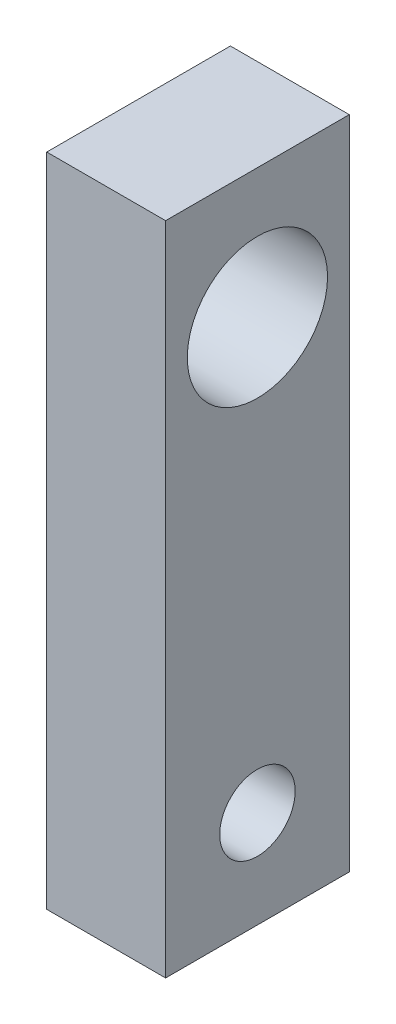
ISO-10303-21;
HEADER;
FILE_DESCRIPTION(('STEP AP214'),'2;1');
FILE_NAME('part.step','',(''),(''),'','','');
FILE_SCHEMA(('AUTOMOTIVE_DESIGN { 1 0 10303 214 1 1 1 1 }'));
ENDSEC;
DATA;
#1=APPLICATION_CONTEXT('core data for automotive mechanical design processes');
#2=APPLICATION_PROTOCOL_DEFINITION('international standard','automotive_design',2000,#1);
#3=PRODUCT_CONTEXT('',#1,'mechanical');
#4=PRODUCT('Part','Part','',(#3));
#5=PRODUCT_RELATED_PRODUCT_CATEGORY('part','',(#4));
#6=PRODUCT_DEFINITION_FORMATION('','',#4);
#7=PRODUCT_DEFINITION_CONTEXT('part definition',#1,'design');
#8=PRODUCT_DEFINITION('design','',#6,#7);
#9=PRODUCT_DEFINITION_SHAPE('','',#8);
#10=(LENGTH_UNIT() NAMED_UNIT(*) SI_UNIT(.MILLI.,.METRE.));
#11=(NAMED_UNIT(*) PLANE_ANGLE_UNIT() SI_UNIT($,.RADIAN.));
#12=(NAMED_UNIT(*) SI_UNIT($,.STERADIAN.) SOLID_ANGLE_UNIT());
#13=UNCERTAINTY_MEASURE_WITH_UNIT(LENGTH_MEASURE(1.E-05),#10,'distance_accuracy_value','');
#14=(GEOMETRIC_REPRESENTATION_CONTEXT(3) GLOBAL_UNCERTAINTY_ASSIGNED_CONTEXT((#13)) GLOBAL_UNIT_ASSIGNED_CONTEXT((#10,
#11,#12)) REPRESENTATION_CONTEXT('',''));
#15=CARTESIAN_POINT('',(0.,0.,0.));
#16=DIRECTION('',(0.,0.,1.));
#17=DIRECTION('',(1.,0.,0.));
#18=AXIS2_PLACEMENT_3D('',#15,#16,#17);
#19=CARTESIAN_POINT('',(3.67,0.,0.));
#20=DIRECTION('',(-1.,0.,0.));
#21=DIRECTION('',(0.,0.,1.));
#22=AXIS2_PLACEMENT_3D('',#19,#20,#21);
#23=PLANE('',#22);
#24=DIRECTION('',(0.,-1.,0.));
#25=VECTOR('',#24,1.);
#26=CARTESIAN_POINT('',(3.67,0.,0.));
#27=LINE('',#26,#25);
#28=CARTESIAN_POINT('',(3.67,20.25,0.));
#29=VERTEX_POINT('',#28);
#30=CARTESIAN_POINT('',(3.67,0.,0.));
#31=VERTEX_POINT('',#30);
#32=EDGE_CURVE('E95',#29,#31,#27,.T.);
#33=ORIENTED_EDGE('',*,*,#32,.T.);
#34=DIRECTION('',(0.,0.,-1.));
#35=VECTOR('',#34,1.);
#36=CARTESIAN_POINT('',(3.67,0.,0.));
#37=LINE('',#36,#35);
#38=CARTESIAN_POINT('',(3.67,0.,-5.67));
#39=VERTEX_POINT('',#38);
#40=EDGE_CURVE('E90',#31,#39,#37,.T.);
#41=ORIENTED_EDGE('',*,*,#40,.T.);
#42=DIRECTION('',(0.,1.,0.));
#43=VECTOR('',#42,1.);
#44=CARTESIAN_POINT('',(3.67,0.,-5.67));
#45=LINE('',#44,#43);
#46=CARTESIAN_POINT('',(3.67,20.25,-5.67));
#47=VERTEX_POINT('',#46);
#48=EDGE_CURVE('E93',#39,#47,#45,.T.);
#49=ORIENTED_EDGE('',*,*,#48,.T.);
#50=DIRECTION('',(0.,0.,1.));
#51=VECTOR('',#50,1.);
#52=CARTESIAN_POINT('',(3.67,20.25,0.));
#53=LINE('',#52,#51);
#54=EDGE_CURVE('E60',#47,#29,#53,.T.);
#55=ORIENTED_EDGE('',*,*,#54,.T.);
#56=EDGE_LOOP('',(#33,#41,#49,#55));
#57=FACE_BOUND('',#56,.T.);
#58=CARTESIAN_POINT('',(3.67,16.25,-2.835));
#59=DIRECTION('',(1.,0.,0.));
#60=DIRECTION('',(0.,0.,-1.));
#61=AXIS2_PLACEMENT_3D('',#58,#59,#60);
#62=CIRCLE('',#61,2.165);
#63=CARTESIAN_POINT('',(3.67,16.25,-5.));
#64=VERTEX_POINT('',#63);
#65=EDGE_CURVE('E110',#64,#64,#62,.T.);
#66=ORIENTED_EDGE('',*,*,#65,.F.);
#67=EDGE_LOOP('',(#66));
#68=FACE_BOUND('',#67,.T.);
#69=CARTESIAN_POINT('',(3.67,3.,-2.835));
#70=DIRECTION('',(1.,0.,0.));
#71=DIRECTION('',(0.,0.,-1.));
#72=AXIS2_PLACEMENT_3D('',#69,#70,#71);
#73=CIRCLE('',#72,1.165);
#74=CARTESIAN_POINT('',(3.67,3.,-4.));
#75=VERTEX_POINT('',#74);
#76=EDGE_CURVE('E125',#75,#75,#73,.T.);
#77=ORIENTED_EDGE('',*,*,#76,.F.);
#78=EDGE_LOOP('',(#77));
#79=FACE_BOUND('',#78,.T.);
#80=ADVANCED_FACE('F43',(#57,#68,#79),#23,.F.);
#81=CARTESIAN_POINT('',(0.,0.,0.));
#82=DIRECTION('',(-1.,0.,0.));
#83=DIRECTION('',(0.,0.,1.));
#84=AXIS2_PLACEMENT_3D('',#81,#82,#83);
#85=PLANE('',#84);
#86=CARTESIAN_POINT('',(0.,16.25,-2.835));
#87=DIRECTION('',(1.,0.,0.));
#88=DIRECTION('',(0.,0.,-1.));
#89=AXIS2_PLACEMENT_3D('',#86,#87,#88);
#90=CIRCLE('',#89,2.165);
#91=CARTESIAN_POINT('',(0.,16.25,-5.));
#92=VERTEX_POINT('',#91);
#93=EDGE_CURVE('E122',#92,#92,#90,.T.);
#94=ORIENTED_EDGE('',*,*,#93,.T.);
#95=EDGE_LOOP('',(#94));
#96=FACE_BOUND('',#95,.T.);
#97=DIRECTION('',(0.,-1.,0.));
#98=VECTOR('',#97,1.);
#99=CARTESIAN_POINT('',(0.,0.,0.));
#100=LINE('',#99,#98);
#101=CARTESIAN_POINT('',(0.,20.25,0.));
#102=VERTEX_POINT('',#101);
#103=CARTESIAN_POINT('',(0.,0.,0.));
#104=VERTEX_POINT('',#103);
#105=EDGE_CURVE('E107',#102,#104,#100,.T.);
#106=ORIENTED_EDGE('',*,*,#105,.F.);
#107=DIRECTION('',(0.,0.,1.));
#108=VECTOR('',#107,1.);
#109=CARTESIAN_POINT('',(0.,20.25,0.));
#110=LINE('',#109,#108);
#111=CARTESIAN_POINT('',(0.,20.25,-5.67));
#112=VERTEX_POINT('',#111);
#113=EDGE_CURVE('E83',#112,#102,#110,.T.);
#114=ORIENTED_EDGE('',*,*,#113,.F.);
#115=DIRECTION('',(0.,1.,0.));
#116=VECTOR('',#115,1.);
#117=CARTESIAN_POINT('',(0.,0.,-5.67));
#118=LINE('',#117,#116);
#119=CARTESIAN_POINT('',(0.,0.,-5.67));
#120=VERTEX_POINT('',#119);
#121=EDGE_CURVE('E77',#120,#112,#118,.T.);
#122=ORIENTED_EDGE('',*,*,#121,.F.);
#123=DIRECTION('',(0.,0.,-1.));
#124=VECTOR('',#123,1.);
#125=CARTESIAN_POINT('',(0.,0.,0.));
#126=LINE('',#125,#124);
#127=EDGE_CURVE('E99',#104,#120,#126,.T.);
#128=ORIENTED_EDGE('',*,*,#127,.F.);
#129=EDGE_LOOP('',(#106,#114,#122,#128));
#130=FACE_BOUND('',#129,.T.);
#131=CARTESIAN_POINT('',(0.,3.,-2.835));
#132=DIRECTION('',(1.,0.,0.));
#133=DIRECTION('',(0.,0.,-1.));
#134=AXIS2_PLACEMENT_3D('',#131,#132,#133);
#135=CIRCLE('',#134,1.165);
#136=CARTESIAN_POINT('',(0.,3.,-4.));
#137=VERTEX_POINT('',#136);
#138=EDGE_CURVE('E128',#137,#137,#135,.T.);
#139=ORIENTED_EDGE('',*,*,#138,.T.);
#140=EDGE_LOOP('',(#139));
#141=FACE_BOUND('',#140,.T.);
#142=ADVANCED_FACE('F118',(#96,#130,#141),#85,.T.);
#143=CARTESIAN_POINT('',(3.67,0.,0.));
#144=DIRECTION('',(0.,0.,-1.));
#145=DIRECTION('',(-1.,0.,0.));
#146=AXIS2_PLACEMENT_3D('',#143,#144,#145);
#147=PLANE('',#146);
#148=ORIENTED_EDGE('',*,*,#105,.T.);
#149=DIRECTION('',(-1.,0.,0.));
#150=VECTOR('',#149,1.);
#151=CARTESIAN_POINT('',(3.67,0.,0.));
#152=LINE('',#151,#150);
#153=EDGE_CURVE('E11',#31,#104,#152,.T.);
#154=ORIENTED_EDGE('',*,*,#153,.F.);
#155=ORIENTED_EDGE('',*,*,#32,.F.);
#156=DIRECTION('',(-1.,0.,0.));
#157=VECTOR('',#156,1.);
#158=CARTESIAN_POINT('',(3.67,20.25,0.));
#159=LINE('',#158,#157);
#160=EDGE_CURVE('E103',#29,#102,#159,.T.);
#161=ORIENTED_EDGE('',*,*,#160,.T.);
#162=EDGE_LOOP('',(#148,#154,#155,#161));
#163=FACE_BOUND('',#162,.T.);
#164=ADVANCED_FACE('F45',(#163),#147,.F.);
#165=CARTESIAN_POINT('',(3.67,0.,0.));
#166=DIRECTION('',(0.,1.,0.));
#167=DIRECTION('',(0.,0.,1.));
#168=AXIS2_PLACEMENT_3D('',#165,#166,#167);
#169=PLANE('',#168);
#170=ORIENTED_EDGE('',*,*,#127,.T.);
#171=DIRECTION('',(-1.,0.,0.));
#172=VECTOR('',#171,1.);
#173=CARTESIAN_POINT('',(3.67,0.,-5.67));
#174=LINE('',#173,#172);
#175=EDGE_CURVE('E52',#39,#120,#174,.T.);
#176=ORIENTED_EDGE('',*,*,#175,.F.);
#177=ORIENTED_EDGE('',*,*,#40,.F.);
#178=ORIENTED_EDGE('',*,*,#153,.T.);
#179=EDGE_LOOP('',(#170,#176,#177,#178));
#180=FACE_BOUND('',#179,.T.);
#181=ADVANCED_FACE('F98',(#180),#169,.F.);
#182=CARTESIAN_POINT('',(3.67,0.,-5.67));
#183=DIRECTION('',(0.,0.,1.));
#184=DIRECTION('',(1.,0.,0.));
#185=AXIS2_PLACEMENT_3D('',#182,#183,#184);
#186=PLANE('',#185);
#187=ORIENTED_EDGE('',*,*,#121,.T.);
#188=DIRECTION('',(-1.,0.,0.));
#189=VECTOR('',#188,1.);
#190=CARTESIAN_POINT('',(3.67,20.25,-5.67));
#191=LINE('',#190,#189);
#192=EDGE_CURVE('E100',#47,#112,#191,.T.);
#193=ORIENTED_EDGE('',*,*,#192,.F.);
#194=ORIENTED_EDGE('',*,*,#48,.F.);
#195=ORIENTED_EDGE('',*,*,#175,.T.);
#196=EDGE_LOOP('',(#187,#193,#194,#195));
#197=FACE_BOUND('',#196,.T.);
#198=ADVANCED_FACE('F101',(#197),#186,.F.);
#199=CARTESIAN_POINT('',(3.67,20.25,0.));
#200=DIRECTION('',(0.,-1.,0.));
#201=DIRECTION('',(0.,0.,-1.));
#202=AXIS2_PLACEMENT_3D('',#199,#200,#201);
#203=PLANE('',#202);
#204=ORIENTED_EDGE('',*,*,#113,.T.);
#205=ORIENTED_EDGE('',*,*,#160,.F.);
#206=ORIENTED_EDGE('',*,*,#54,.F.);
#207=ORIENTED_EDGE('',*,*,#192,.T.);
#208=EDGE_LOOP('',(#204,#205,#206,#207));
#209=FACE_BOUND('',#208,.T.);
#210=ADVANCED_FACE('F115',(#209),#203,.F.);
#211=CARTESIAN_POINT('',(3.67,16.25,-2.835));
#212=DIRECTION('',(-1.,0.,0.));
#213=DIRECTION('',(0.,0.,1.));
#214=AXIS2_PLACEMENT_3D('',#211,#212,#213);
#215=CYLINDRICAL_SURFACE('',#214,2.165);
#216=ORIENTED_EDGE('',*,*,#65,.T.);
#217=EDGE_LOOP('',(#216));
#218=FACE_BOUND('',#217,.T.);
#219=ORIENTED_EDGE('',*,*,#93,.F.);
#220=EDGE_LOOP('',(#219));
#221=FACE_BOUND('',#220,.T.);
#222=ADVANCED_FACE('F145',(#218,#221),#215,.F.);
#223=CARTESIAN_POINT('',(3.67,3.,-2.835));
#224=DIRECTION('',(-1.,0.,0.));
#225=DIRECTION('',(0.,0.,1.));
#226=AXIS2_PLACEMENT_3D('',#223,#224,#225);
#227=CYLINDRICAL_SURFACE('',#226,1.165);
#228=ORIENTED_EDGE('',*,*,#76,.T.);
#229=EDGE_LOOP('',(#228));
#230=FACE_BOUND('',#229,.T.);
#231=ORIENTED_EDGE('',*,*,#138,.F.);
#232=EDGE_LOOP('',(#231));
#233=FACE_BOUND('',#232,.T.);
#234=ADVANCED_FACE('F134',(#230,#233),#227,.F.);
#235=CLOSED_SHELL('',(#80,#142,#164,#181,#198,#210,#222,#234));
#236=MANIFOLD_SOLID_BREP('B2',#235);
#237=ADVANCED_BREP_SHAPE_REPRESENTATION('',(#18,#236),#14);
#238=SHAPE_DEFINITION_REPRESENTATION(#9,#237);
ENDSEC;
END-ISO-10303-21;
